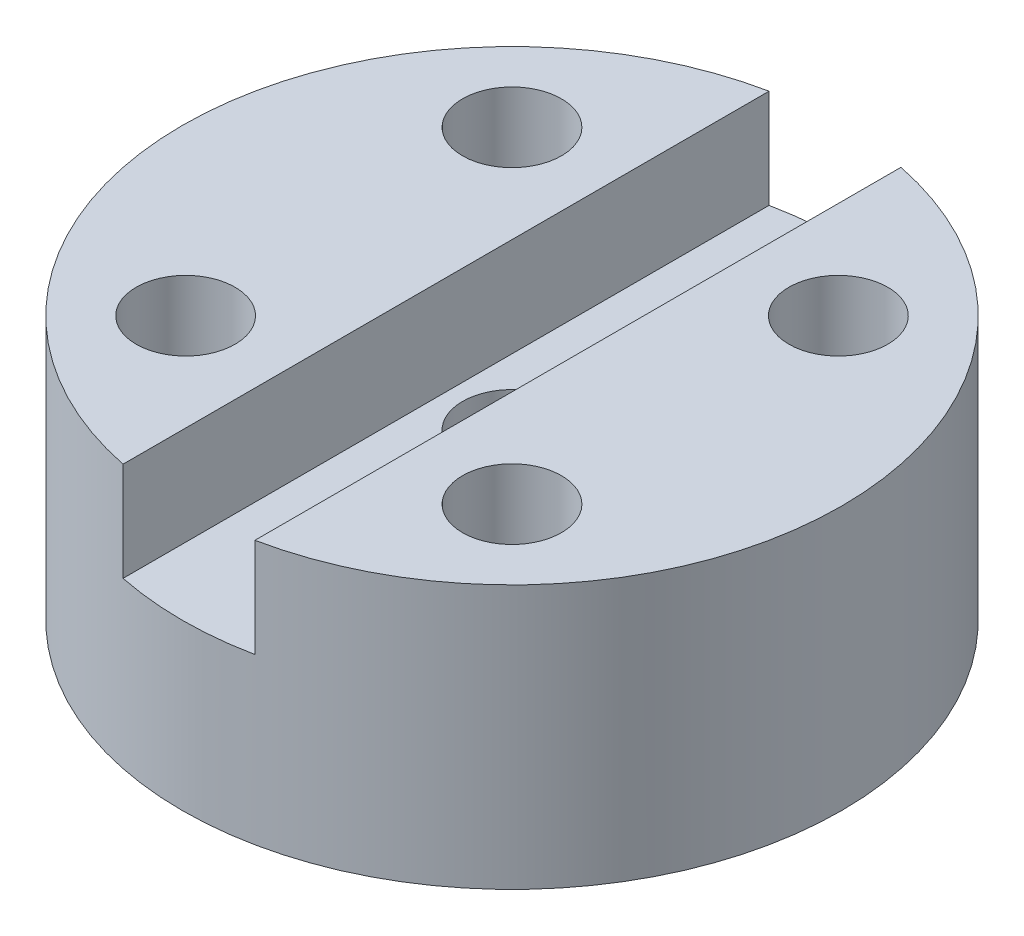
ISO-10303-21;
HEADER;
FILE_DESCRIPTION(('STEP AP214'),'2;1');
FILE_NAME('part.step','',(''),(''),'','','');
FILE_SCHEMA(('AUTOMOTIVE_DESIGN { 1 0 10303 214 1 1 1 1 }'));
ENDSEC;
DATA;
#1=APPLICATION_CONTEXT('core data for automotive mechanical design processes');
#2=APPLICATION_PROTOCOL_DEFINITION('international standard','automotive_design',2000,#1);
#3=PRODUCT_CONTEXT('',#1,'mechanical');
#4=PRODUCT('Part','Part','',(#3));
#5=PRODUCT_RELATED_PRODUCT_CATEGORY('part','',(#4));
#6=PRODUCT_DEFINITION_FORMATION('','',#4);
#7=PRODUCT_DEFINITION_CONTEXT('part definition',#1,'design');
#8=PRODUCT_DEFINITION('design','',#6,#7);
#9=PRODUCT_DEFINITION_SHAPE('','',#8);
#10=(LENGTH_UNIT() NAMED_UNIT(*) SI_UNIT(.MILLI.,.METRE.));
#11=(NAMED_UNIT(*) PLANE_ANGLE_UNIT() SI_UNIT($,.RADIAN.));
#12=(NAMED_UNIT(*) SI_UNIT($,.STERADIAN.) SOLID_ANGLE_UNIT());
#13=UNCERTAINTY_MEASURE_WITH_UNIT(LENGTH_MEASURE(1.E-05),#10,'distance_accuracy_value','');
#14=(GEOMETRIC_REPRESENTATION_CONTEXT(3) GLOBAL_UNCERTAINTY_ASSIGNED_CONTEXT((#13)) GLOBAL_UNIT_ASSIGNED_CONTEXT((#10,
#11,#12)) REPRESENTATION_CONTEXT('',''));
#15=CARTESIAN_POINT('',(0.,0.,0.));
#16=DIRECTION('',(0.,0.,1.));
#17=DIRECTION('',(1.,0.,0.));
#18=AXIS2_PLACEMENT_3D('',#15,#16,#17);
#19=CARTESIAN_POINT('',(0.,8.,0.));
#20=DIRECTION('',(0.,-1.,0.));
#21=DIRECTION('',(0.,0.,-1.));
#22=AXIS2_PLACEMENT_3D('',#19,#20,#21);
#23=CYLINDRICAL_SURFACE('',#22,1.5);
#24=CARTESIAN_POINT('',(0.,5.,0.));
#25=DIRECTION('',(0.,1.,0.));
#26=DIRECTION('',(0.,0.,1.));
#27=AXIS2_PLACEMENT_3D('',#24,#25,#26);
#28=CIRCLE('',#27,1.5);
#29=CARTESIAN_POINT('',(0.,5.,1.5));
#30=VERTEX_POINT('',#29);
#31=EDGE_CURVE('E110',#30,#30,#28,.T.);
#32=ORIENTED_EDGE('',*,*,#31,.T.);
#33=EDGE_LOOP('',(#32));
#34=FACE_BOUND('',#33,.T.);
#35=CARTESIAN_POINT('',(0.,3.,0.));
#36=DIRECTION('',(0.,-1.,0.));
#37=DIRECTION('',(0.,0.,-1.));
#38=AXIS2_PLACEMENT_3D('',#35,#36,#37);
#39=CIRCLE('',#38,1.5);
#40=CARTESIAN_POINT('',(0.,3.,-1.5));
#41=VERTEX_POINT('',#40);
#42=EDGE_CURVE('E42',#41,#41,#39,.T.);
#43=ORIENTED_EDGE('',*,*,#42,.T.);
#44=EDGE_LOOP('',(#43));
#45=FACE_BOUND('',#44,.T.);
#46=ADVANCED_FACE('F38',(#34,#45),#23,.F.);
#47=CARTESIAN_POINT('',(0.,8.,0.));
#48=DIRECTION('',(0.,1.,0.));
#49=DIRECTION('',(0.,0.,1.));
#50=AXIS2_PLACEMENT_3D('',#47,#48,#49);
#51=PLANE('',#50);
#52=DIRECTION('',(0.,0.,-1.));
#53=VECTOR('',#52,1.);
#54=CARTESIAN_POINT('',(2.,8.,-11.3681751179474));
#55=LINE('',#54,#53);
#56=CARTESIAN_POINT('',(2.,8.,9.79795897113271));
#57=VERTEX_POINT('',#56);
#58=CARTESIAN_POINT('',(2.,8.,-9.79795897113271));
#59=VERTEX_POINT('',#58);
#60=EDGE_CURVE('E82',#57,#59,#55,.T.);
#61=ORIENTED_EDGE('',*,*,#60,.F.);
#62=CARTESIAN_POINT('',(0.,8.,0.));
#63=DIRECTION('',(0.,1.,0.));
#64=DIRECTION('',(0.,0.,1.));
#65=AXIS2_PLACEMENT_3D('',#62,#63,#64);
#66=CIRCLE('',#65,10.);
#67=EDGE_CURVE('E93',#57,#59,#66,.T.);
#68=ORIENTED_EDGE('',*,*,#67,.T.);
#69=EDGE_LOOP('',(#61,#68));
#70=FACE_BOUND('',#69,.T.);
#71=CARTESIAN_POINT('',(4.94974746830583,8.,-4.94974746830583));
#72=DIRECTION('',(0.,1.,0.));
#73=DIRECTION('',(0.,0.,1.));
#74=AXIS2_PLACEMENT_3D('',#71,#72,#73);
#75=CIRCLE('',#74,1.5);
#76=CARTESIAN_POINT('',(4.94974746830583,8.,-3.44974746830583));
#77=VERTEX_POINT('',#76);
#78=EDGE_CURVE('E109',#77,#77,#75,.T.);
#79=ORIENTED_EDGE('',*,*,#78,.F.);
#80=EDGE_LOOP('',(#79));
#81=FACE_BOUND('',#80,.T.);
#82=CARTESIAN_POINT('',(4.94974746830583,8.,4.94974746830583));
#83=DIRECTION('',(0.,1.,0.));
#84=DIRECTION('',(0.,0.,1.));
#85=AXIS2_PLACEMENT_3D('',#82,#83,#84);
#86=CIRCLE('',#85,1.5);
#87=CARTESIAN_POINT('',(4.94974746830583,8.,6.44974746830583));
#88=VERTEX_POINT('',#87);
#89=EDGE_CURVE('E127',#88,#88,#86,.T.);
#90=ORIENTED_EDGE('',*,*,#89,.F.);
#91=EDGE_LOOP('',(#90));
#92=FACE_BOUND('',#91,.T.);
#93=ADVANCED_FACE('F91',(#70,#81,#92),#51,.T.);
#94=DIRECTION('',(0.,0.,1.));
#95=VECTOR('',#94,1.);
#96=CARTESIAN_POINT('',(-2.,8.,-11.3681751179474));
#97=LINE('',#96,#95);
#98=CARTESIAN_POINT('',(-2.,8.,-9.79795897113271));
#99=VERTEX_POINT('',#98);
#100=CARTESIAN_POINT('',(-2.,8.,9.79795897113271));
#101=VERTEX_POINT('',#100);
#102=EDGE_CURVE('E94',#99,#101,#97,.T.);
#103=ORIENTED_EDGE('',*,*,#102,.F.);
#104=EDGE_CURVE('E97',#99,#101,#66,.T.);
#105=ORIENTED_EDGE('',*,*,#104,.T.);
#106=EDGE_LOOP('',(#103,#105));
#107=FACE_BOUND('',#106,.T.);
#108=CARTESIAN_POINT('',(-4.94974746830583,8.,-4.94974746830583));
#109=DIRECTION('',(0.,1.,0.));
#110=DIRECTION('',(0.,0.,1.));
#111=AXIS2_PLACEMENT_3D('',#108,#109,#110);
#112=CIRCLE('',#111,1.5);
#113=CARTESIAN_POINT('',(-4.94974746830583,8.,-3.44974746830583));
#114=VERTEX_POINT('',#113);
#115=EDGE_CURVE('E140',#114,#114,#112,.T.);
#116=ORIENTED_EDGE('',*,*,#115,.F.);
#117=EDGE_LOOP('',(#116));
#118=FACE_BOUND('',#117,.T.);
#119=CARTESIAN_POINT('',(-4.94974746830583,8.,4.94974746830583));
#120=DIRECTION('',(0.,1.,0.));
#121=DIRECTION('',(0.,0.,1.));
#122=AXIS2_PLACEMENT_3D('',#119,#120,#121);
#123=CIRCLE('',#122,1.5);
#124=CARTESIAN_POINT('',(-4.94974746830583,8.,6.44974746830583));
#125=VERTEX_POINT('',#124);
#126=EDGE_CURVE('E134',#125,#125,#123,.T.);
#127=ORIENTED_EDGE('',*,*,#126,.F.);
#128=EDGE_LOOP('',(#127));
#129=FACE_BOUND('',#128,.T.);
#130=ADVANCED_FACE('F120',(#107,#118,#129),#51,.T.);
#131=CARTESIAN_POINT('',(0.,0.,0.));
#132=DIRECTION('',(0.,1.,0.));
#133=DIRECTION('',(0.,0.,1.));
#134=AXIS2_PLACEMENT_3D('',#131,#132,#133);
#135=PLANE('',#134);
#136=CARTESIAN_POINT('',(0.,0.,0.));
#137=DIRECTION('',(0.,-1.,0.));
#138=DIRECTION('',(0.,0.,-1.));
#139=AXIS2_PLACEMENT_3D('',#136,#137,#138);
#140=CIRCLE('',#139,3.5);
#141=CARTESIAN_POINT('',(0.,0.,-3.5));
#142=VERTEX_POINT('',#141);
#143=EDGE_CURVE('E198',#142,#142,#140,.T.);
#144=ORIENTED_EDGE('',*,*,#143,.F.);
#145=EDGE_LOOP('',(#144));
#146=FACE_BOUND('',#145,.T.);
#147=CARTESIAN_POINT('',(0.,0.,0.));
#148=DIRECTION('',(0.,1.,0.));
#149=DIRECTION('',(0.,0.,1.));
#150=AXIS2_PLACEMENT_3D('',#147,#148,#149);
#151=CIRCLE('',#150,10.);
#152=CARTESIAN_POINT('',(0.,0.,10.));
#153=VERTEX_POINT('',#152);
#154=EDGE_CURVE('E102',#153,#153,#151,.T.);
#155=ORIENTED_EDGE('',*,*,#154,.F.);
#156=EDGE_LOOP('',(#155));
#157=FACE_BOUND('',#156,.T.);
#158=CARTESIAN_POINT('',(4.94974746830583,0.,-4.94974746830583));
#159=DIRECTION('',(0.,1.,0.));
#160=DIRECTION('',(0.,0.,1.));
#161=AXIS2_PLACEMENT_3D('',#158,#159,#160);
#162=CIRCLE('',#161,1.5);
#163=CARTESIAN_POINT('',(4.94974746830583,0.,-3.44974746830583));
#164=VERTEX_POINT('',#163);
#165=EDGE_CURVE('E105',#164,#164,#162,.T.);
#166=ORIENTED_EDGE('',*,*,#165,.T.);
#167=EDGE_LOOP('',(#166));
#168=FACE_BOUND('',#167,.T.);
#169=CARTESIAN_POINT('',(-4.94974746830583,0.,-4.94974746830583));
#170=DIRECTION('',(0.,1.,0.));
#171=DIRECTION('',(0.,0.,1.));
#172=AXIS2_PLACEMENT_3D('',#169,#170,#171);
#173=CIRCLE('',#172,1.5);
#174=CARTESIAN_POINT('',(-4.94974746830583,0.,-3.44974746830583));
#175=VERTEX_POINT('',#174);
#176=EDGE_CURVE('E137',#175,#175,#173,.T.);
#177=ORIENTED_EDGE('',*,*,#176,.T.);
#178=EDGE_LOOP('',(#177));
#179=FACE_BOUND('',#178,.T.);
#180=CARTESIAN_POINT('',(-4.94974746830583,0.,4.94974746830583));
#181=DIRECTION('',(0.,1.,0.));
#182=DIRECTION('',(0.,0.,1.));
#183=AXIS2_PLACEMENT_3D('',#180,#181,#182);
#184=CIRCLE('',#183,1.5);
#185=CARTESIAN_POINT('',(-4.94974746830583,0.,6.44974746830583));
#186=VERTEX_POINT('',#185);
#187=EDGE_CURVE('E130',#186,#186,#184,.T.);
#188=ORIENTED_EDGE('',*,*,#187,.T.);
#189=EDGE_LOOP('',(#188));
#190=FACE_BOUND('',#189,.T.);
#191=CARTESIAN_POINT('',(4.94974746830583,0.,4.94974746830583));
#192=DIRECTION('',(0.,1.,0.));
#193=DIRECTION('',(0.,0.,1.));
#194=AXIS2_PLACEMENT_3D('',#191,#192,#193);
#195=CIRCLE('',#194,1.5);
#196=CARTESIAN_POINT('',(4.94974746830583,0.,6.44974746830583));
#197=VERTEX_POINT('',#196);
#198=EDGE_CURVE('E131',#197,#197,#195,.T.);
#199=ORIENTED_EDGE('',*,*,#198,.T.);
#200=EDGE_LOOP('',(#199));
#201=FACE_BOUND('',#200,.T.);
#202=ADVANCED_FACE('F150',(#146,#157,#168,#179,#190,#201),#135,.F.);
#203=CARTESIAN_POINT('',(0.,8.,0.));
#204=DIRECTION('',(0.,-1.,0.));
#205=DIRECTION('',(0.,0.,-1.));
#206=AXIS2_PLACEMENT_3D('',#203,#204,#205);
#207=CYLINDRICAL_SURFACE('',#206,10.);
#208=CARTESIAN_POINT('',(0.,5.,0.));
#209=DIRECTION('',(0.,1.,0.));
#210=DIRECTION('',(0.,0.,1.));
#211=AXIS2_PLACEMENT_3D('',#208,#209,#210);
#212=CIRCLE('',#211,10.);
#213=CARTESIAN_POINT('',(2.,5.,-9.79795897113271));
#214=VERTEX_POINT('',#213);
#215=CARTESIAN_POINT('',(-2.,5.,-9.79795897113271));
#216=VERTEX_POINT('',#215);
#217=EDGE_CURVE('E59',#214,#216,#212,.T.);
#218=ORIENTED_EDGE('',*,*,#217,.F.);
#219=DIRECTION('',(0.,-1.,0.));
#220=VECTOR('',#219,1.);
#221=CARTESIAN_POINT('',(2.,8.,-9.79795897113271));
#222=LINE('',#221,#220);
#223=EDGE_CURVE('E11',#214,#59,#222,.F.);
#224=ORIENTED_EDGE('',*,*,#223,.T.);
#225=ORIENTED_EDGE('',*,*,#67,.F.);
#226=DIRECTION('',(0.,-1.,0.));
#227=VECTOR('',#226,1.);
#228=CARTESIAN_POINT('',(2.,8.,9.79795897113271));
#229=LINE('',#228,#227);
#230=CARTESIAN_POINT('',(2.,5.,9.79795897113271));
#231=VERTEX_POINT('',#230);
#232=EDGE_CURVE('E79',#57,#231,#229,.T.);
#233=ORIENTED_EDGE('',*,*,#232,.T.);
#234=CARTESIAN_POINT('',(-2.,5.,9.79795897113271));
#235=VERTEX_POINT('',#234);
#236=EDGE_CURVE('E112',#235,#231,#212,.T.);
#237=ORIENTED_EDGE('',*,*,#236,.F.);
#238=DIRECTION('',(0.,-1.,0.));
#239=VECTOR('',#238,1.);
#240=CARTESIAN_POINT('',(-2.,8.,9.79795897113271));
#241=LINE('',#240,#239);
#242=EDGE_CURVE('E87',#235,#101,#241,.F.);
#243=ORIENTED_EDGE('',*,*,#242,.T.);
#244=ORIENTED_EDGE('',*,*,#104,.F.);
#245=DIRECTION('',(0.,-1.,0.));
#246=VECTOR('',#245,1.);
#247=CARTESIAN_POINT('',(-2.,8.,-9.79795897113271));
#248=LINE('',#247,#246);
#249=EDGE_CURVE('E47',#99,#216,#248,.T.);
#250=ORIENTED_EDGE('',*,*,#249,.T.);
#251=EDGE_LOOP('',(#218,#224,#225,#233,#237,#243,#244,#250));
#252=FACE_BOUND('',#251,.T.);
#253=ORIENTED_EDGE('',*,*,#154,.T.);
#254=EDGE_LOOP('',(#253));
#255=FACE_BOUND('',#254,.T.);
#256=ADVANCED_FACE('F40',(#252,#255),#207,.T.);
#257=CARTESIAN_POINT('',(4.94974746830583,8.,-4.94974746830583));
#258=DIRECTION('',(0.,-1.,0.));
#259=DIRECTION('',(0.,0.,-1.));
#260=AXIS2_PLACEMENT_3D('',#257,#258,#259);
#261=CYLINDRICAL_SURFACE('',#260,1.5);
#262=ORIENTED_EDGE('',*,*,#78,.T.);
#263=EDGE_LOOP('',(#262));
#264=FACE_BOUND('',#263,.T.);
#265=ORIENTED_EDGE('',*,*,#165,.F.);
#266=EDGE_LOOP('',(#265));
#267=FACE_BOUND('',#266,.T.);
#268=ADVANCED_FACE('F153',(#264,#267),#261,.F.);
#269=CARTESIAN_POINT('',(-4.94974746830583,8.,-4.94974746830583));
#270=DIRECTION('',(0.,-1.,0.));
#271=DIRECTION('',(0.,0.,-1.));
#272=AXIS2_PLACEMENT_3D('',#269,#270,#271);
#273=CYLINDRICAL_SURFACE('',#272,1.5);
#274=ORIENTED_EDGE('',*,*,#115,.T.);
#275=EDGE_LOOP('',(#274));
#276=FACE_BOUND('',#275,.T.);
#277=ORIENTED_EDGE('',*,*,#176,.F.);
#278=EDGE_LOOP('',(#277));
#279=FACE_BOUND('',#278,.T.);
#280=ADVANCED_FACE('F155',(#276,#279),#273,.F.);
#281=CARTESIAN_POINT('',(-4.94974746830583,8.,4.94974746830583));
#282=DIRECTION('',(0.,-1.,0.));
#283=DIRECTION('',(0.,0.,-1.));
#284=AXIS2_PLACEMENT_3D('',#281,#282,#283);
#285=CYLINDRICAL_SURFACE('',#284,1.5);
#286=ORIENTED_EDGE('',*,*,#126,.T.);
#287=EDGE_LOOP('',(#286));
#288=FACE_BOUND('',#287,.T.);
#289=ORIENTED_EDGE('',*,*,#187,.F.);
#290=EDGE_LOOP('',(#289));
#291=FACE_BOUND('',#290,.T.);
#292=ADVANCED_FACE('F161',(#288,#291),#285,.F.);
#293=CARTESIAN_POINT('',(4.94974746830583,8.,4.94974746830583));
#294=DIRECTION('',(0.,-1.,0.));
#295=DIRECTION('',(0.,0.,-1.));
#296=AXIS2_PLACEMENT_3D('',#293,#294,#295);
#297=CYLINDRICAL_SURFACE('',#296,1.5);
#298=ORIENTED_EDGE('',*,*,#89,.T.);
#299=EDGE_LOOP('',(#298));
#300=FACE_BOUND('',#299,.T.);
#301=ORIENTED_EDGE('',*,*,#198,.F.);
#302=EDGE_LOOP('',(#301));
#303=FACE_BOUND('',#302,.T.);
#304=ADVANCED_FACE('F175',(#300,#303),#297,.F.);
#305=CARTESIAN_POINT('',(2.,5.,-11.3681751179474));
#306=DIRECTION('',(1.,0.,0.));
#307=DIRECTION('',(0.,0.,-1.));
#308=AXIS2_PLACEMENT_3D('',#305,#306,#307);
#309=PLANE('',#308);
#310=ORIENTED_EDGE('',*,*,#60,.T.);
#311=ORIENTED_EDGE('',*,*,#223,.F.);
#312=DIRECTION('',(0.,0.,-1.));
#313=VECTOR('',#312,1.);
#314=CARTESIAN_POINT('',(2.,5.,-11.3681751179474));
#315=LINE('',#314,#313);
#316=EDGE_CURVE('E83',#231,#214,#315,.T.);
#317=ORIENTED_EDGE('',*,*,#316,.F.);
#318=ORIENTED_EDGE('',*,*,#232,.F.);
#319=EDGE_LOOP('',(#310,#311,#317,#318));
#320=FACE_BOUND('',#319,.T.);
#321=ADVANCED_FACE('F81',(#320),#309,.F.);
#322=CARTESIAN_POINT('',(-2.,5.,-11.3681751179474));
#323=DIRECTION('',(-1.,0.,0.));
#324=DIRECTION('',(0.,0.,1.));
#325=AXIS2_PLACEMENT_3D('',#322,#323,#324);
#326=PLANE('',#325);
#327=ORIENTED_EDGE('',*,*,#102,.T.);
#328=ORIENTED_EDGE('',*,*,#242,.F.);
#329=DIRECTION('',(0.,0.,1.));
#330=VECTOR('',#329,1.);
#331=CARTESIAN_POINT('',(-2.,5.,-11.3681751179474));
#332=LINE('',#331,#330);
#333=EDGE_CURVE('E54',#216,#235,#332,.T.);
#334=ORIENTED_EDGE('',*,*,#333,.F.);
#335=ORIENTED_EDGE('',*,*,#249,.F.);
#336=EDGE_LOOP('',(#327,#328,#334,#335));
#337=FACE_BOUND('',#336,.T.);
#338=ADVANCED_FACE('F118',(#337),#326,.F.);
#339=CARTESIAN_POINT('',(0.,5.,0.));
#340=DIRECTION('',(0.,1.,0.));
#341=DIRECTION('',(0.,0.,1.));
#342=AXIS2_PLACEMENT_3D('',#339,#340,#341);
#343=PLANE('',#342);
#344=ORIENTED_EDGE('',*,*,#31,.F.);
#345=EDGE_LOOP('',(#344));
#346=FACE_BOUND('',#345,.T.);
#347=ORIENTED_EDGE('',*,*,#217,.T.);
#348=ORIENTED_EDGE('',*,*,#333,.T.);
#349=ORIENTED_EDGE('',*,*,#236,.T.);
#350=ORIENTED_EDGE('',*,*,#316,.T.);
#351=EDGE_LOOP('',(#347,#348,#349,#350));
#352=FACE_BOUND('',#351,.T.);
#353=ADVANCED_FACE('F217',(#346,#352),#343,.T.);
#354=CARTESIAN_POINT('',(0.,3.,0.));
#355=DIRECTION('',(0.,-1.,0.));
#356=DIRECTION('',(0.,0.,-1.));
#357=AXIS2_PLACEMENT_3D('',#354,#355,#356);
#358=CYLINDRICAL_SURFACE('',#357,3.5);
#359=CARTESIAN_POINT('',(0.,3.,0.));
#360=DIRECTION('',(0.,-1.,0.));
#361=DIRECTION('',(0.,0.,-1.));
#362=AXIS2_PLACEMENT_3D('',#359,#360,#361);
#363=CIRCLE('',#362,3.5);
#364=CARTESIAN_POINT('',(0.,3.,-3.5));
#365=VERTEX_POINT('',#364);
#366=EDGE_CURVE('E201',#365,#365,#363,.T.);
#367=ORIENTED_EDGE('',*,*,#366,.F.);
#368=EDGE_LOOP('',(#367));
#369=FACE_BOUND('',#368,.T.);
#370=ORIENTED_EDGE('',*,*,#143,.T.);
#371=EDGE_LOOP('',(#370));
#372=FACE_BOUND('',#371,.T.);
#373=ADVANCED_FACE('F212',(#369,#372),#358,.F.);
#374=CARTESIAN_POINT('',(0.,3.,0.));
#375=DIRECTION('',(0.,-1.,0.));
#376=DIRECTION('',(0.,0.,-1.));
#377=AXIS2_PLACEMENT_3D('',#374,#375,#376);
#378=PLANE('',#377);
#379=ORIENTED_EDGE('',*,*,#42,.F.);
#380=EDGE_LOOP('',(#379));
#381=FACE_BOUND('',#380,.T.);
#382=ORIENTED_EDGE('',*,*,#366,.T.);
#383=EDGE_LOOP('',(#382));
#384=FACE_BOUND('',#383,.T.);
#385=ADVANCED_FACE('F210',(#381,#384),#378,.T.);
#386=CLOSED_SHELL('',(#46,#93,#130,#202,#256,#268,#280,#292,#304,#321,#338,#353,#373,#385));
#387=MANIFOLD_SOLID_BREP('B2',#386);
#388=ADVANCED_BREP_SHAPE_REPRESENTATION('',(#18,#387),#14);
#389=SHAPE_DEFINITION_REPRESENTATION(#9,#388);
ENDSEC;
END-ISO-10303-21;
